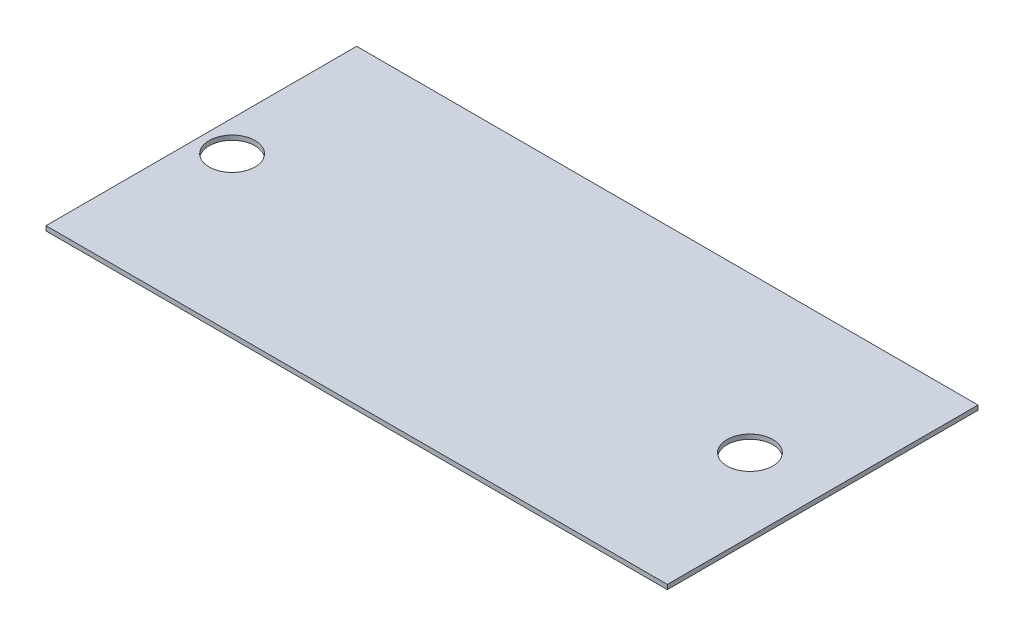
ISO-10303-21;
HEADER;
FILE_DESCRIPTION(('STEP AP214'),'2;1');
FILE_NAME('part.step','',(''),(''),'','','');
FILE_SCHEMA(('AUTOMOTIVE_DESIGN { 1 0 10303 214 1 1 1 1 }'));
ENDSEC;
DATA;
#1=APPLICATION_CONTEXT('core data for automotive mechanical design processes');
#2=APPLICATION_PROTOCOL_DEFINITION('international standard','automotive_design',2000,#1);
#3=PRODUCT_CONTEXT('',#1,'mechanical');
#4=PRODUCT('Part','Part','',(#3));
#5=PRODUCT_RELATED_PRODUCT_CATEGORY('part','',(#4));
#6=PRODUCT_DEFINITION_FORMATION('','',#4);
#7=PRODUCT_DEFINITION_CONTEXT('part definition',#1,'design');
#8=PRODUCT_DEFINITION('design','',#6,#7);
#9=PRODUCT_DEFINITION_SHAPE('','',#8);
#10=(LENGTH_UNIT() NAMED_UNIT(*) SI_UNIT(.MILLI.,.METRE.));
#11=(NAMED_UNIT(*) PLANE_ANGLE_UNIT() SI_UNIT($,.RADIAN.));
#12=(NAMED_UNIT(*) SI_UNIT($,.STERADIAN.) SOLID_ANGLE_UNIT());
#13=UNCERTAINTY_MEASURE_WITH_UNIT(LENGTH_MEASURE(1.E-05),#10,'distance_accuracy_value','');
#14=(GEOMETRIC_REPRESENTATION_CONTEXT(3) GLOBAL_UNCERTAINTY_ASSIGNED_CONTEXT((#13)) GLOBAL_UNIT_ASSIGNED_CONTEXT((#10,
#11,#12)) REPRESENTATION_CONTEXT('',''));
#15=CARTESIAN_POINT('',(0.,0.,0.));
#16=DIRECTION('',(0.,0.,1.));
#17=DIRECTION('',(1.,0.,0.));
#18=AXIS2_PLACEMENT_3D('',#15,#16,#17);
#19=CARTESIAN_POINT('',(0.,3.,0.));
#20=DIRECTION('',(1.,0.,0.));
#21=DIRECTION('',(0.,0.,-1.));
#22=AXIS2_PLACEMENT_3D('',#19,#20,#21);
#23=PLANE('',#22);
#24=DIRECTION('',(0.,0.,1.));
#25=VECTOR('',#24,1.);
#26=CARTESIAN_POINT('',(0.,0.,0.));
#27=LINE('',#26,#25);
#28=CARTESIAN_POINT('',(0.,0.,-203.2));
#29=VERTEX_POINT('',#28);
#30=CARTESIAN_POINT('',(0.,0.,0.));
#31=VERTEX_POINT('',#30);
#32=EDGE_CURVE('E105',#29,#31,#27,.T.);
#33=ORIENTED_EDGE('',*,*,#32,.T.);
#34=DIRECTION('',(0.,-1.,0.));
#35=VECTOR('',#34,1.);
#36=CARTESIAN_POINT('',(0.,3.,0.));
#37=LINE('',#36,#35);
#38=CARTESIAN_POINT('',(0.,3.,0.));
#39=VERTEX_POINT('',#38);
#40=EDGE_CURVE('E11',#39,#31,#37,.T.);
#41=ORIENTED_EDGE('',*,*,#40,.F.);
#42=DIRECTION('',(0.,0.,1.));
#43=VECTOR('',#42,1.);
#44=CARTESIAN_POINT('',(0.,3.,0.));
#45=LINE('',#44,#43);
#46=CARTESIAN_POINT('',(0.,3.,-203.2));
#47=VERTEX_POINT('',#46);
#48=EDGE_CURVE('E89',#47,#39,#45,.T.);
#49=ORIENTED_EDGE('',*,*,#48,.F.);
#50=DIRECTION('',(0.,-1.,0.));
#51=VECTOR('',#50,1.);
#52=CARTESIAN_POINT('',(0.,3.,-203.2));
#53=LINE('',#52,#51);
#54=EDGE_CURVE('E97',#47,#29,#53,.T.);
#55=ORIENTED_EDGE('',*,*,#54,.T.);
#56=EDGE_LOOP('',(#33,#41,#49,#55));
#57=FACE_BOUND('',#56,.T.);
#58=ADVANCED_FACE('F39',(#57),#23,.F.);
#59=CARTESIAN_POINT('',(0.,3.,0.));
#60=DIRECTION('',(0.,0.,-1.));
#61=DIRECTION('',(-1.,0.,0.));
#62=AXIS2_PLACEMENT_3D('',#59,#60,#61);
#63=PLANE('',#62);
#64=DIRECTION('',(1.,0.,0.));
#65=VECTOR('',#64,1.);
#66=CARTESIAN_POINT('',(0.,0.,0.));
#67=LINE('',#66,#65);
#68=CARTESIAN_POINT('',(406.4,0.,0.));
#69=VERTEX_POINT('',#68);
#70=EDGE_CURVE('E92',#31,#69,#67,.T.);
#71=ORIENTED_EDGE('',*,*,#70,.T.);
#72=DIRECTION('',(0.,-1.,0.));
#73=VECTOR('',#72,1.);
#74=CARTESIAN_POINT('',(406.4,3.,0.));
#75=LINE('',#74,#73);
#76=CARTESIAN_POINT('',(406.4,3.,0.));
#77=VERTEX_POINT('',#76);
#78=EDGE_CURVE('E50',#77,#69,#75,.T.);
#79=ORIENTED_EDGE('',*,*,#78,.F.);
#80=DIRECTION('',(1.,0.,0.));
#81=VECTOR('',#80,1.);
#82=CARTESIAN_POINT('',(0.,3.,0.));
#83=LINE('',#82,#81);
#84=EDGE_CURVE('E82',#39,#77,#83,.T.);
#85=ORIENTED_EDGE('',*,*,#84,.F.);
#86=ORIENTED_EDGE('',*,*,#40,.T.);
#87=EDGE_LOOP('',(#71,#79,#85,#86));
#88=FACE_BOUND('',#87,.T.);
#89=ADVANCED_FACE('F93',(#88),#63,.F.);
#90=CARTESIAN_POINT('',(406.4,3.,0.));
#91=DIRECTION('',(-1.,0.,0.));
#92=DIRECTION('',(0.,0.,1.));
#93=AXIS2_PLACEMENT_3D('',#90,#91,#92);
#94=PLANE('',#93);
#95=DIRECTION('',(0.,0.,-1.));
#96=VECTOR('',#95,1.);
#97=CARTESIAN_POINT('',(406.4,0.,0.));
#98=LINE('',#97,#96);
#99=CARTESIAN_POINT('',(406.4,0.,-203.2));
#100=VERTEX_POINT('',#99);
#101=EDGE_CURVE('E75',#69,#100,#98,.T.);
#102=ORIENTED_EDGE('',*,*,#101,.T.);
#103=DIRECTION('',(0.,-1.,0.));
#104=VECTOR('',#103,1.);
#105=CARTESIAN_POINT('',(406.4,3.,-203.2));
#106=LINE('',#105,#104);
#107=CARTESIAN_POINT('',(406.4,3.,-203.2));
#108=VERTEX_POINT('',#107);
#109=EDGE_CURVE('E94',#108,#100,#106,.T.);
#110=ORIENTED_EDGE('',*,*,#109,.F.);
#111=DIRECTION('',(0.,0.,-1.));
#112=VECTOR('',#111,1.);
#113=CARTESIAN_POINT('',(406.4,3.,0.));
#114=LINE('',#113,#112);
#115=EDGE_CURVE('E88',#77,#108,#114,.T.);
#116=ORIENTED_EDGE('',*,*,#115,.F.);
#117=ORIENTED_EDGE('',*,*,#78,.T.);
#118=EDGE_LOOP('',(#102,#110,#116,#117));
#119=FACE_BOUND('',#118,.T.);
#120=ADVANCED_FACE('F96',(#119),#94,.F.);
#121=CARTESIAN_POINT('',(0.,3.,-203.2));
#122=DIRECTION('',(0.,0.,1.));
#123=DIRECTION('',(1.,0.,0.));
#124=AXIS2_PLACEMENT_3D('',#121,#122,#123);
#125=PLANE('',#124);
#126=DIRECTION('',(-1.,0.,0.));
#127=VECTOR('',#126,1.);
#128=CARTESIAN_POINT('',(0.,0.,-203.2));
#129=LINE('',#128,#127);
#130=EDGE_CURVE('E76',#100,#29,#129,.T.);
#131=ORIENTED_EDGE('',*,*,#130,.T.);
#132=ORIENTED_EDGE('',*,*,#54,.F.);
#133=DIRECTION('',(-1.,0.,0.));
#134=VECTOR('',#133,1.);
#135=CARTESIAN_POINT('',(0.,3.,-203.2));
#136=LINE('',#135,#134);
#137=EDGE_CURVE('E54',#108,#47,#136,.T.);
#138=ORIENTED_EDGE('',*,*,#137,.F.);
#139=ORIENTED_EDGE('',*,*,#109,.T.);
#140=EDGE_LOOP('',(#131,#132,#138,#139));
#141=FACE_BOUND('',#140,.T.);
#142=ADVANCED_FACE('F106',(#141),#125,.F.);
#143=CARTESIAN_POINT('',(0.,3.,0.));
#144=DIRECTION('',(0.,-1.,0.));
#145=DIRECTION('',(0.,0.,-1.));
#146=AXIS2_PLACEMENT_3D('',#143,#144,#145);
#147=PLANE('',#146);
#148=CARTESIAN_POINT('',(20.1228107087559,3.,-101.6));
#149=DIRECTION('',(0.,1.,0.));
#150=DIRECTION('',(0.,0.,1.));
#151=AXIS2_PLACEMENT_3D('',#148,#149,#150);
#152=CIRCLE('',#151,15.);
#153=CARTESIAN_POINT('',(20.1228107087559,3.,-86.6));
#154=VERTEX_POINT('',#153);
#155=EDGE_CURVE('E122',#154,#154,#152,.T.);
#156=ORIENTED_EDGE('',*,*,#155,.F.);
#157=EDGE_LOOP('',(#156));
#158=FACE_BOUND('',#157,.T.);
#159=CARTESIAN_POINT('',(358.831003766682,3.,-101.6));
#160=DIRECTION('',(0.,1.,0.));
#161=DIRECTION('',(0.,0.,1.));
#162=AXIS2_PLACEMENT_3D('',#159,#160,#161);
#163=CIRCLE('',#162,15.);
#164=CARTESIAN_POINT('',(358.831003766682,3.,-86.6));
#165=VERTEX_POINT('',#164);
#166=EDGE_CURVE('E119',#165,#165,#163,.T.);
#167=ORIENTED_EDGE('',*,*,#166,.F.);
#168=EDGE_LOOP('',(#167));
#169=FACE_BOUND('',#168,.T.);
#170=ORIENTED_EDGE('',*,*,#48,.T.);
#171=ORIENTED_EDGE('',*,*,#84,.T.);
#172=ORIENTED_EDGE('',*,*,#115,.T.);
#173=ORIENTED_EDGE('',*,*,#137,.T.);
#174=EDGE_LOOP('',(#170,#171,#172,#173));
#175=FACE_BOUND('',#174,.T.);
#176=ADVANCED_FACE('F86',(#158,#169,#175),#147,.F.);
#177=CARTESIAN_POINT('',(0.,0.,0.));
#178=DIRECTION('',(0.,-1.,0.));
#179=DIRECTION('',(0.,0.,-1.));
#180=AXIS2_PLACEMENT_3D('',#177,#178,#179);
#181=PLANE('',#180);
#182=CARTESIAN_POINT('',(20.1228107087559,0.,-101.6));
#183=DIRECTION('',(0.,1.,0.));
#184=DIRECTION('',(0.,0.,1.));
#185=AXIS2_PLACEMENT_3D('',#182,#183,#184);
#186=CIRCLE('',#185,15.);
#187=CARTESIAN_POINT('',(20.1228107087559,0.,-86.6));
#188=VERTEX_POINT('',#187);
#189=EDGE_CURVE('E103',#188,#188,#186,.T.);
#190=ORIENTED_EDGE('',*,*,#189,.T.);
#191=EDGE_LOOP('',(#190));
#192=FACE_BOUND('',#191,.T.);
#193=CARTESIAN_POINT('',(358.831003766682,0.,-101.6));
#194=DIRECTION('',(0.,1.,0.));
#195=DIRECTION('',(0.,0.,1.));
#196=AXIS2_PLACEMENT_3D('',#193,#194,#195);
#197=CIRCLE('',#196,15.);
#198=CARTESIAN_POINT('',(358.831003766682,0.,-86.6));
#199=VERTEX_POINT('',#198);
#200=EDGE_CURVE('E117',#199,#199,#197,.T.);
#201=ORIENTED_EDGE('',*,*,#200,.T.);
#202=EDGE_LOOP('',(#201));
#203=FACE_BOUND('',#202,.T.);
#204=ORIENTED_EDGE('',*,*,#32,.F.);
#205=ORIENTED_EDGE('',*,*,#130,.F.);
#206=ORIENTED_EDGE('',*,*,#101,.F.);
#207=ORIENTED_EDGE('',*,*,#70,.F.);
#208=EDGE_LOOP('',(#204,#205,#206,#207));
#209=FACE_BOUND('',#208,.T.);
#210=ADVANCED_FACE('F111',(#192,#203,#209),#181,.T.);
#211=CARTESIAN_POINT('',(358.831003766682,0.,-101.6));
#212=DIRECTION('',(0.,1.,0.));
#213=DIRECTION('',(0.,0.,1.));
#214=AXIS2_PLACEMENT_3D('',#211,#212,#213);
#215=CYLINDRICAL_SURFACE('',#214,15.);
#216=ORIENTED_EDGE('',*,*,#200,.F.);
#217=EDGE_LOOP('',(#216));
#218=FACE_BOUND('',#217,.T.);
#219=ORIENTED_EDGE('',*,*,#166,.T.);
#220=EDGE_LOOP('',(#219));
#221=FACE_BOUND('',#220,.T.);
#222=ADVANCED_FACE('F133',(#218,#221),#215,.F.);
#223=CARTESIAN_POINT('',(20.1228107087559,0.,-101.6));
#224=DIRECTION('',(0.,1.,0.));
#225=DIRECTION('',(0.,0.,1.));
#226=AXIS2_PLACEMENT_3D('',#223,#224,#225);
#227=CYLINDRICAL_SURFACE('',#226,15.);
#228=ORIENTED_EDGE('',*,*,#189,.F.);
#229=EDGE_LOOP('',(#228));
#230=FACE_BOUND('',#229,.T.);
#231=ORIENTED_EDGE('',*,*,#155,.T.);
#232=EDGE_LOOP('',(#231));
#233=FACE_BOUND('',#232,.T.);
#234=ADVANCED_FACE('F127',(#230,#233),#227,.F.);
#235=CLOSED_SHELL('',(#58,#89,#120,#142,#176,#210,#222,#234));
#236=MANIFOLD_SOLID_BREP('B2',#235);
#237=ADVANCED_BREP_SHAPE_REPRESENTATION('',(#18,#236),#14);
#238=SHAPE_DEFINITION_REPRESENTATION(#9,#237);
ENDSEC;
END-ISO-10303-21;
